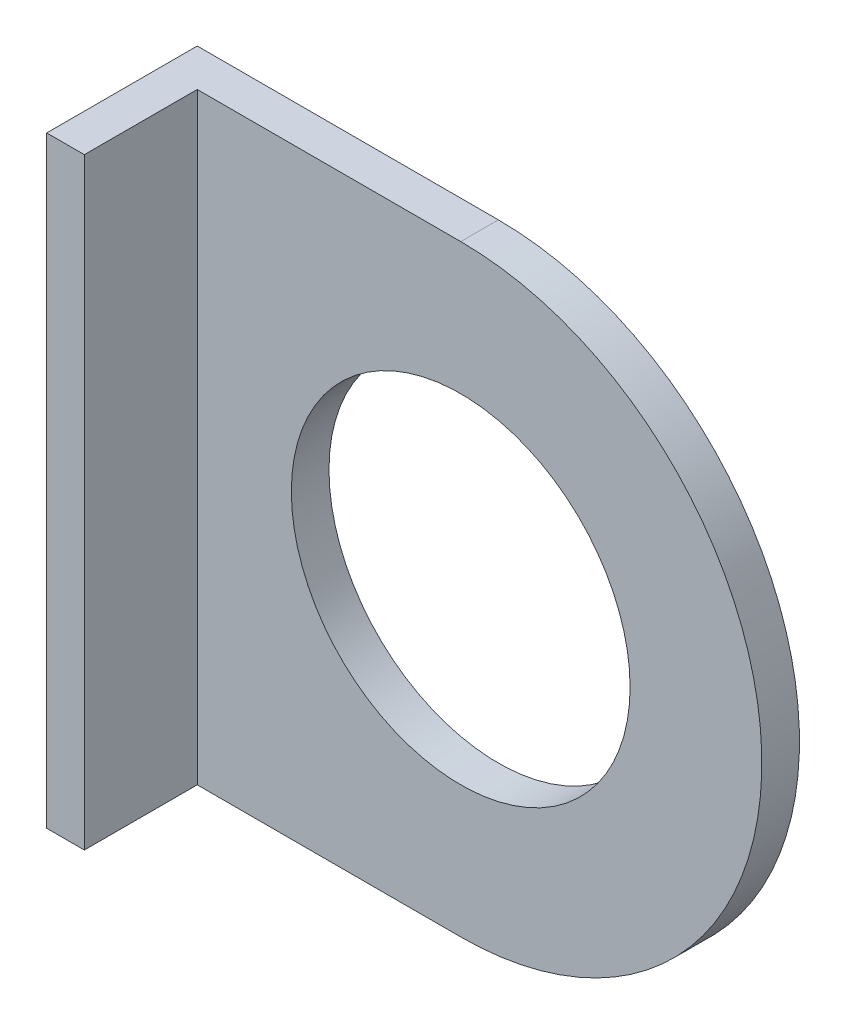
ISO-10303-21;
HEADER;
FILE_DESCRIPTION(('STEP AP214'),'2;1');
FILE_NAME('part.step','',(''),(''),'','','');
FILE_SCHEMA(('AUTOMOTIVE_DESIGN { 1 0 10303 214 1 1 1 1 }'));
ENDSEC;
DATA;
#1=APPLICATION_CONTEXT('core data for automotive mechanical design processes');
#2=APPLICATION_PROTOCOL_DEFINITION('international standard','automotive_design',2000,#1);
#3=PRODUCT_CONTEXT('',#1,'mechanical');
#4=PRODUCT('Part','Part','',(#3));
#5=PRODUCT_RELATED_PRODUCT_CATEGORY('part','',(#4));
#6=PRODUCT_DEFINITION_FORMATION('','',#4);
#7=PRODUCT_DEFINITION_CONTEXT('part definition',#1,'design');
#8=PRODUCT_DEFINITION('design','',#6,#7);
#9=PRODUCT_DEFINITION_SHAPE('','',#8);
#10=(LENGTH_UNIT() NAMED_UNIT(*) SI_UNIT(.MILLI.,.METRE.));
#11=(NAMED_UNIT(*) PLANE_ANGLE_UNIT() SI_UNIT($,.RADIAN.));
#12=(NAMED_UNIT(*) SI_UNIT($,.STERADIAN.) SOLID_ANGLE_UNIT());
#13=UNCERTAINTY_MEASURE_WITH_UNIT(LENGTH_MEASURE(1.E-05),#10,'distance_accuracy_value','');
#14=(GEOMETRIC_REPRESENTATION_CONTEXT(3) GLOBAL_UNCERTAINTY_ASSIGNED_CONTEXT((#13)) GLOBAL_UNIT_ASSIGNED_CONTEXT((#10,
#11,#12)) REPRESENTATION_CONTEXT('',''));
#15=CARTESIAN_POINT('',(0.,0.,0.));
#16=DIRECTION('',(0.,0.,1.));
#17=DIRECTION('',(1.,0.,0.));
#18=AXIS2_PLACEMENT_3D('',#15,#16,#17);
#19=CARTESIAN_POINT('',(77.3767843489452,-176.084673508477,312.442180797453));
#20=DIRECTION('',(0.,0.,-1.));
#21=DIRECTION('',(-1.,0.,0.));
#22=AXIS2_PLACEMENT_3D('',#19,#20,#21);
#23=PLANE('',#22);
#24=CARTESIAN_POINT('',(77.3767843489452,-176.084673508477,312.442180797453));
#25=DIRECTION('',(0.,0.,1.));
#26=DIRECTION('',(1.,0.,0.));
#27=AXIS2_PLACEMENT_3D('',#24,#25,#26);
#28=CIRCLE('',#27,14.2874999999999);
#29=CARTESIAN_POINT('',(91.6642843489451,-176.084673508477,312.442180797453));
#30=VERTEX_POINT('',#29);
#31=EDGE_CURVE('E101',#30,#30,#28,.T.);
#32=ORIENTED_EDGE('',*,*,#31,.F.);
#33=EDGE_LOOP('',(#32));
#34=FACE_BOUND('',#33,.T.);
#35=DIRECTION('',(0.,1.,0.));
#36=VECTOR('',#35,1.);
#37=CARTESIAN_POINT('',(55.1517843489452,-150.684673508477,312.442180797453));
#38=LINE('',#37,#36);
#39=CARTESIAN_POINT('',(55.1517843489452,-201.484673508477,312.442180797453));
#40=VERTEX_POINT('',#39);
#41=CARTESIAN_POINT('',(55.1517843489452,-150.684673508477,312.442180797453));
#42=VERTEX_POINT('',#41);
#43=EDGE_CURVE('E54',#40,#42,#38,.T.);
#44=ORIENTED_EDGE('',*,*,#43,.F.);
#45=DIRECTION('',(1.,0.,0.));
#46=VECTOR('',#45,1.);
#47=CARTESIAN_POINT('',(77.3767843489452,-201.484673508477,312.442180797453));
#48=LINE('',#47,#46);
#49=CARTESIAN_POINT('',(77.3767843489452,-201.484673508477,312.442180797453));
#50=VERTEX_POINT('',#49);
#51=EDGE_CURVE('E147',#40,#50,#48,.T.);
#52=ORIENTED_EDGE('',*,*,#51,.T.);
#53=CARTESIAN_POINT('',(77.3767843489452,-176.084673508477,312.442180797453));
#54=DIRECTION('',(0.,0.,1.));
#55=DIRECTION('',(-1.,0.,0.));
#56=AXIS2_PLACEMENT_3D('',#53,#54,#55);
#57=CIRCLE('',#56,25.4);
#58=CARTESIAN_POINT('',(77.3767843489452,-150.684673508477,312.442180797453));
#59=VERTEX_POINT('',#58);
#60=EDGE_CURVE('E60',#50,#59,#57,.T.);
#61=ORIENTED_EDGE('',*,*,#60,.T.);
#62=DIRECTION('',(-1.,0.,0.));
#63=VECTOR('',#62,1.);
#64=CARTESIAN_POINT('',(51.9767843489452,-150.684673508477,312.442180797453));
#65=LINE('',#64,#63);
#66=EDGE_CURVE('E89',#59,#42,#65,.T.);
#67=ORIENTED_EDGE('',*,*,#66,.T.);
#68=EDGE_LOOP('',(#44,#52,#61,#67));
#69=FACE_BOUND('',#68,.T.);
#70=ADVANCED_FACE('F39',(#34,#69),#23,.F.);
#71=CARTESIAN_POINT('',(77.3767843489452,-176.084673508477,309.267180797453));
#72=DIRECTION('',(0.,0.,-1.));
#73=DIRECTION('',(-1.,0.,0.));
#74=AXIS2_PLACEMENT_3D('',#71,#72,#73);
#75=PLANE('',#74);
#76=DIRECTION('',(-1.,0.,0.));
#77=VECTOR('',#76,1.);
#78=CARTESIAN_POINT('',(51.9767843489452,-150.684673508477,309.267180797453));
#79=LINE('',#78,#77);
#80=CARTESIAN_POINT('',(77.3767843489452,-150.684673508477,309.267180797453));
#81=VERTEX_POINT('',#80);
#82=CARTESIAN_POINT('',(51.9767843489452,-150.684673508477,309.267180797453));
#83=VERTEX_POINT('',#82);
#84=EDGE_CURVE('E95',#81,#83,#79,.T.);
#85=ORIENTED_EDGE('',*,*,#84,.F.);
#86=CARTESIAN_POINT('',(77.3767843489452,-176.084673508477,309.267180797453));
#87=DIRECTION('',(0.,0.,1.));
#88=DIRECTION('',(-1.,0.,0.));
#89=AXIS2_PLACEMENT_3D('',#86,#87,#88);
#90=CIRCLE('',#89,25.4);
#91=CARTESIAN_POINT('',(77.3767843489452,-201.484673508477,309.267180797453));
#92=VERTEX_POINT('',#91);
#93=EDGE_CURVE('E79',#92,#81,#90,.T.);
#94=ORIENTED_EDGE('',*,*,#93,.F.);
#95=DIRECTION('',(1.,0.,0.));
#96=VECTOR('',#95,1.);
#97=CARTESIAN_POINT('',(77.3767843489452,-201.484673508477,309.267180797453));
#98=LINE('',#97,#96);
#99=CARTESIAN_POINT('',(51.9767843489452,-201.484673508477,309.267180797453));
#100=VERTEX_POINT('',#99);
#101=EDGE_CURVE('E90',#100,#92,#98,.T.);
#102=ORIENTED_EDGE('',*,*,#101,.F.);
#103=DIRECTION('',(0.,-1.,0.));
#104=VECTOR('',#103,1.);
#105=CARTESIAN_POINT('',(51.9767843489452,-201.484673508477,309.267180797453));
#106=LINE('',#105,#104);
#107=EDGE_CURVE('E100',#83,#100,#106,.T.);
#108=ORIENTED_EDGE('',*,*,#107,.F.);
#109=EDGE_LOOP('',(#85,#94,#102,#108));
#110=FACE_BOUND('',#109,.T.);
#111=CARTESIAN_POINT('',(77.3767843489452,-176.084673508477,309.267180797453));
#112=DIRECTION('',(0.,0.,1.));
#113=DIRECTION('',(1.,0.,0.));
#114=AXIS2_PLACEMENT_3D('',#111,#112,#113);
#115=CIRCLE('',#114,14.2874999999999);
#116=CARTESIAN_POINT('',(91.6642843489451,-176.084673508477,309.267180797453));
#117=VERTEX_POINT('',#116);
#118=EDGE_CURVE('E105',#117,#117,#115,.T.);
#119=ORIENTED_EDGE('',*,*,#118,.T.);
#120=EDGE_LOOP('',(#119));
#121=FACE_BOUND('',#120,.T.);
#122=ADVANCED_FACE('F98',(#110,#121),#75,.T.);
#123=CARTESIAN_POINT('',(51.9767843489452,-150.684673508477,312.442180797453));
#124=DIRECTION('',(0.,-1.,0.));
#125=DIRECTION('',(0.,0.,-1.));
#126=AXIS2_PLACEMENT_3D('',#123,#124,#125);
#127=PLANE('',#126);
#128=ORIENTED_EDGE('',*,*,#84,.T.);
#129=DIRECTION('',(0.,0.,-1.));
#130=VECTOR('',#129,1.);
#131=CARTESIAN_POINT('',(51.9767843489452,-150.684673508477,312.442180797453));
#132=LINE('',#131,#130);
#133=CARTESIAN_POINT('',(51.9767843489452,-150.684673508477,321.967180797453));
#134=VERTEX_POINT('',#133);
#135=EDGE_CURVE('E11',#134,#83,#132,.T.);
#136=ORIENTED_EDGE('',*,*,#135,.F.);
#137=DIRECTION('',(-1.,0.,0.));
#138=VECTOR('',#137,1.);
#139=CARTESIAN_POINT('',(55.1517843489452,-150.684673508477,321.967180797453));
#140=LINE('',#139,#138);
#141=CARTESIAN_POINT('',(55.1517843489452,-150.684673508477,321.967180797453));
#142=VERTEX_POINT('',#141);
#143=EDGE_CURVE('E132',#142,#134,#140,.T.);
#144=ORIENTED_EDGE('',*,*,#143,.F.);
#145=DIRECTION('',(0.,0.,-1.));
#146=VECTOR('',#145,1.);
#147=CARTESIAN_POINT('',(55.1517843489452,-150.684673508477,321.967180797453));
#148=LINE('',#147,#146);
#149=EDGE_CURVE('E143',#142,#42,#148,.T.);
#150=ORIENTED_EDGE('',*,*,#149,.T.);
#151=ORIENTED_EDGE('',*,*,#66,.F.);
#152=DIRECTION('',(0.,0.,-1.));
#153=VECTOR('',#152,1.);
#154=CARTESIAN_POINT('',(77.3767843489452,-150.684673508477,312.442180797453));
#155=LINE('',#154,#153);
#156=EDGE_CURVE('E82',#59,#81,#155,.T.);
#157=ORIENTED_EDGE('',*,*,#156,.T.);
#158=EDGE_LOOP('',(#128,#136,#144,#150,#151,#157));
#159=FACE_BOUND('',#158,.T.);
#160=ADVANCED_FACE('F41',(#159),#127,.F.);
#161=CARTESIAN_POINT('',(51.9767843489452,-201.484673508477,312.442180797453));
#162=DIRECTION('',(1.,0.,0.));
#163=DIRECTION('',(0.,0.,-1.));
#164=AXIS2_PLACEMENT_3D('',#161,#162,#163);
#165=PLANE('',#164);
#166=ORIENTED_EDGE('',*,*,#107,.T.);
#167=DIRECTION('',(0.,0.,-1.));
#168=VECTOR('',#167,1.);
#169=CARTESIAN_POINT('',(51.9767843489452,-201.484673508477,312.442180797453));
#170=LINE('',#169,#168);
#171=CARTESIAN_POINT('',(51.9767843489452,-201.484673508477,321.967180797453));
#172=VERTEX_POINT('',#171);
#173=EDGE_CURVE('E47',#172,#100,#170,.T.);
#174=ORIENTED_EDGE('',*,*,#173,.F.);
#175=DIRECTION('',(0.,-1.,0.));
#176=VECTOR('',#175,1.);
#177=CARTESIAN_POINT('',(51.9767843489452,-150.684673508477,321.967180797453));
#178=LINE('',#177,#176);
#179=EDGE_CURVE('E125',#134,#172,#178,.T.);
#180=ORIENTED_EDGE('',*,*,#179,.F.);
#181=ORIENTED_EDGE('',*,*,#135,.T.);
#182=EDGE_LOOP('',(#166,#174,#180,#181));
#183=FACE_BOUND('',#182,.T.);
#184=ADVANCED_FACE('F123',(#183),#165,.F.);
#185=CARTESIAN_POINT('',(77.3767843489452,-201.484673508477,312.442180797453));
#186=DIRECTION('',(0.,1.,0.));
#187=DIRECTION('',(0.,0.,1.));
#188=AXIS2_PLACEMENT_3D('',#185,#186,#187);
#189=PLANE('',#188);
#190=ORIENTED_EDGE('',*,*,#101,.T.);
#191=DIRECTION('',(0.,0.,-1.));
#192=VECTOR('',#191,1.);
#193=CARTESIAN_POINT('',(77.3767843489452,-201.484673508477,312.442180797453));
#194=LINE('',#193,#192);
#195=EDGE_CURVE('E85',#50,#92,#194,.T.);
#196=ORIENTED_EDGE('',*,*,#195,.F.);
#197=ORIENTED_EDGE('',*,*,#51,.F.);
#198=DIRECTION('',(0.,0.,-1.));
#199=VECTOR('',#198,1.);
#200=CARTESIAN_POINT('',(55.1517843489452,-201.484673508477,321.967180797453));
#201=LINE('',#200,#199);
#202=CARTESIAN_POINT('',(55.1517843489452,-201.484673508477,321.967180797453));
#203=VERTEX_POINT('',#202);
#204=EDGE_CURVE('E134',#203,#40,#201,.T.);
#205=ORIENTED_EDGE('',*,*,#204,.F.);
#206=DIRECTION('',(1.,0.,0.));
#207=VECTOR('',#206,1.);
#208=CARTESIAN_POINT('',(55.1517843489452,-201.484673508477,321.967180797453));
#209=LINE('',#208,#207);
#210=EDGE_CURVE('E119',#172,#203,#209,.T.);
#211=ORIENTED_EDGE('',*,*,#210,.F.);
#212=ORIENTED_EDGE('',*,*,#173,.T.);
#213=EDGE_LOOP('',(#190,#196,#197,#205,#211,#212));
#214=FACE_BOUND('',#213,.T.);
#215=ADVANCED_FACE('F115',(#214),#189,.F.);
#216=CARTESIAN_POINT('',(77.3767843489452,-176.084673508477,312.442180797453));
#217=DIRECTION('',(0.,0.,-1.));
#218=DIRECTION('',(-1.,0.,0.));
#219=AXIS2_PLACEMENT_3D('',#216,#217,#218);
#220=CYLINDRICAL_SURFACE('',#219,25.4);
#221=ORIENTED_EDGE('',*,*,#93,.T.);
#222=ORIENTED_EDGE('',*,*,#156,.F.);
#223=ORIENTED_EDGE('',*,*,#60,.F.);
#224=ORIENTED_EDGE('',*,*,#195,.T.);
#225=EDGE_LOOP('',(#221,#222,#223,#224));
#226=FACE_BOUND('',#225,.T.);
#227=ADVANCED_FACE('F81',(#226),#220,.T.);
#228=CARTESIAN_POINT('',(77.3767843489452,-176.084673508477,312.442180797453));
#229=DIRECTION('',(0.,0.,-1.));
#230=DIRECTION('',(-1.,0.,0.));
#231=AXIS2_PLACEMENT_3D('',#228,#229,#230);
#232=CYLINDRICAL_SURFACE('',#231,14.2874999999999);
#233=ORIENTED_EDGE('',*,*,#31,.T.);
#234=EDGE_LOOP('',(#233));
#235=FACE_BOUND('',#234,.T.);
#236=ORIENTED_EDGE('',*,*,#118,.F.);
#237=EDGE_LOOP('',(#236));
#238=FACE_BOUND('',#237,.T.);
#239=ADVANCED_FACE('F158',(#235,#238),#232,.F.);
#240=CARTESIAN_POINT('',(55.1517843489452,-150.684673508477,321.967180797453));
#241=DIRECTION('',(-1.,0.,0.));
#242=DIRECTION('',(0.,-1.,0.));
#243=AXIS2_PLACEMENT_3D('',#240,#241,#242);
#244=PLANE('',#243);
#245=ORIENTED_EDGE('',*,*,#43,.T.);
#246=ORIENTED_EDGE('',*,*,#149,.F.);
#247=DIRECTION('',(0.,1.,0.));
#248=VECTOR('',#247,1.);
#249=CARTESIAN_POINT('',(55.1517843489452,-150.684673508477,321.967180797453));
#250=LINE('',#249,#248);
#251=EDGE_CURVE('E136',#203,#142,#250,.T.);
#252=ORIENTED_EDGE('',*,*,#251,.F.);
#253=ORIENTED_EDGE('',*,*,#204,.T.);
#254=EDGE_LOOP('',(#245,#246,#252,#253));
#255=FACE_BOUND('',#254,.T.);
#256=ADVANCED_FACE('F150',(#255),#244,.F.);
#257=CARTESIAN_POINT('',(0.,0.,321.967180797453));
#258=DIRECTION('',(0.,0.,-1.));
#259=DIRECTION('',(-1.,0.,0.));
#260=AXIS2_PLACEMENT_3D('',#257,#258,#259);
#261=PLANE('',#260);
#262=ORIENTED_EDGE('',*,*,#251,.T.);
#263=ORIENTED_EDGE('',*,*,#143,.T.);
#264=ORIENTED_EDGE('',*,*,#179,.T.);
#265=ORIENTED_EDGE('',*,*,#210,.T.);
#266=EDGE_LOOP('',(#262,#263,#264,#265));
#267=FACE_BOUND('',#266,.T.);
#268=ADVANCED_FACE('F130',(#267),#261,.F.);
#269=CLOSED_SHELL('',(#70,#122,#160,#184,#215,#227,#239,#256,#268));
#270=MANIFOLD_SOLID_BREP('B2',#269);
#271=ADVANCED_BREP_SHAPE_REPRESENTATION('',(#18,#270),#14);
#272=SHAPE_DEFINITION_REPRESENTATION(#9,#271);
ENDSEC;
END-ISO-10303-21;
